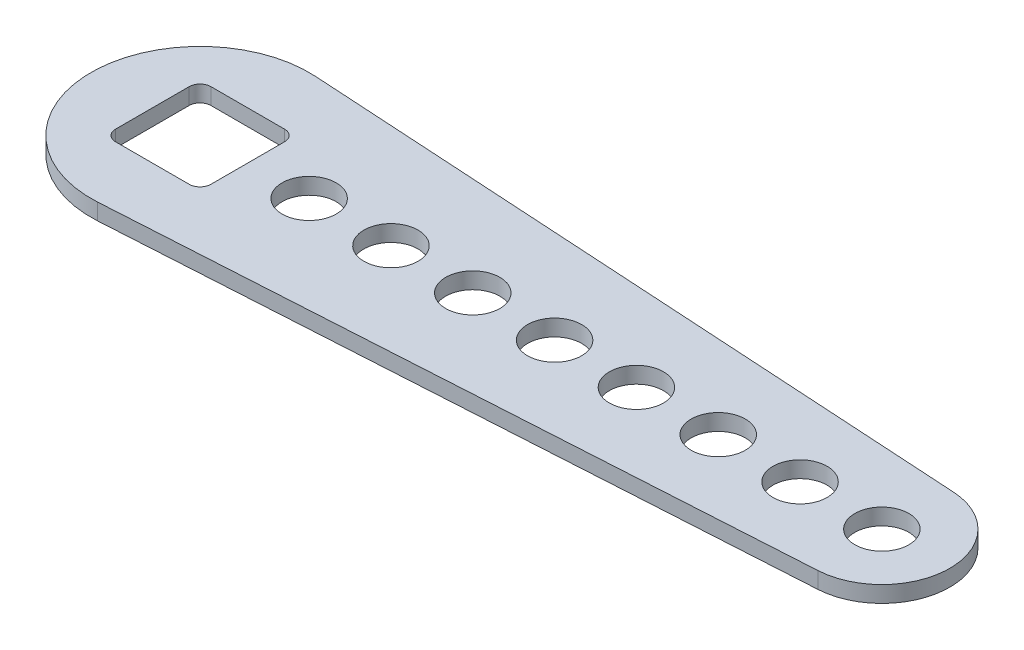
ISO-10303-21;
HEADER;
FILE_DESCRIPTION(('STEP AP214'),'2;1');
FILE_NAME('part.step','',(''),(''),'','','');
FILE_SCHEMA(('AUTOMOTIVE_DESIGN { 1 0 10303 214 1 1 1 1 }'));
ENDSEC;
DATA;
#1=APPLICATION_CONTEXT('core data for automotive mechanical design processes');
#2=APPLICATION_PROTOCOL_DEFINITION('international standard','automotive_design',2000,#1);
#3=PRODUCT_CONTEXT('',#1,'mechanical');
#4=PRODUCT('Part','Part','',(#3));
#5=PRODUCT_RELATED_PRODUCT_CATEGORY('part','',(#4));
#6=PRODUCT_DEFINITION_FORMATION('','',#4);
#7=PRODUCT_DEFINITION_CONTEXT('part definition',#1,'design');
#8=PRODUCT_DEFINITION('design','',#6,#7);
#9=PRODUCT_DEFINITION_SHAPE('','',#8);
#10=(LENGTH_UNIT() NAMED_UNIT(*) SI_UNIT(.MILLI.,.METRE.));
#11=(NAMED_UNIT(*) PLANE_ANGLE_UNIT() SI_UNIT($,.RADIAN.));
#12=(NAMED_UNIT(*) SI_UNIT($,.STERADIAN.) SOLID_ANGLE_UNIT());
#13=UNCERTAINTY_MEASURE_WITH_UNIT(LENGTH_MEASURE(1.E-05),#10,'distance_accuracy_value','');
#14=(GEOMETRIC_REPRESENTATION_CONTEXT(3) GLOBAL_UNCERTAINTY_ASSIGNED_CONTEXT((#13)) GLOBAL_UNIT_ASSIGNED_CONTEXT((#10,
#11,#12)) REPRESENTATION_CONTEXT('',''));
#15=CARTESIAN_POINT('',(0.,0.,0.));
#16=DIRECTION('',(0.,0.,1.));
#17=DIRECTION('',(1.,0.,0.));
#18=AXIS2_PLACEMENT_3D('',#15,#16,#17);
#19=CARTESIAN_POINT('',(0.,2.4,0.));
#20=DIRECTION('',(0.,1.,0.));
#21=DIRECTION('',(0.,0.,1.));
#22=AXIS2_PLACEMENT_3D('',#19,#20,#21);
#23=PLANE('',#22);
#24=CARTESIAN_POINT('',(88.,2.4,0.));
#25=DIRECTION('',(0.,1.,0.));
#26=DIRECTION('',(0.,0.,1.));
#27=AXIS2_PLACEMENT_3D('',#24,#25,#26);
#28=CIRCLE('',#27,3.96875);
#29=CARTESIAN_POINT('',(88.,2.4,3.96875));
#30=VERTEX_POINT('',#29);
#31=EDGE_CURVE('E159',#30,#30,#28,.T.);
#32=ORIENTED_EDGE('',*,*,#31,.F.);
#33=EDGE_LOOP('',(#32));
#34=FACE_BOUND('',#33,.T.);
#35=CARTESIAN_POINT('',(76.,2.4,0.));
#36=DIRECTION('',(0.,1.,0.));
#37=DIRECTION('',(0.,0.,1.));
#38=AXIS2_PLACEMENT_3D('',#35,#36,#37);
#39=CIRCLE('',#38,3.96875);
#40=CARTESIAN_POINT('',(76.,2.4,3.96875));
#41=VERTEX_POINT('',#40);
#42=EDGE_CURVE('E189',#41,#41,#39,.T.);
#43=ORIENTED_EDGE('',*,*,#42,.F.);
#44=EDGE_LOOP('',(#43));
#45=FACE_BOUND('',#44,.T.);
#46=CARTESIAN_POINT('',(52.,2.4,0.));
#47=DIRECTION('',(0.,1.,0.));
#48=DIRECTION('',(0.,0.,1.));
#49=AXIS2_PLACEMENT_3D('',#46,#47,#48);
#50=CIRCLE('',#49,3.96875);
#51=CARTESIAN_POINT('',(52.,2.4,3.96875));
#52=VERTEX_POINT('',#51);
#53=EDGE_CURVE('E201',#52,#52,#50,.T.);
#54=ORIENTED_EDGE('',*,*,#53,.F.);
#55=EDGE_LOOP('',(#54));
#56=FACE_BOUND('',#55,.T.);
#57=CARTESIAN_POINT('',(28.,2.4,0.));
#58=DIRECTION('',(0.,1.,0.));
#59=DIRECTION('',(0.,0.,1.));
#60=AXIS2_PLACEMENT_3D('',#57,#58,#59);
#61=CIRCLE('',#60,3.96875);
#62=CARTESIAN_POINT('',(28.,2.4,3.96875));
#63=VERTEX_POINT('',#62);
#64=EDGE_CURVE('E213',#63,#63,#61,.T.);
#65=ORIENTED_EDGE('',*,*,#64,.F.);
#66=EDGE_LOOP('',(#65));
#67=FACE_BOUND('',#66,.T.);
#68=CARTESIAN_POINT('',(0.,2.4,0.));
#69=DIRECTION('',(0.,1.,0.));
#70=DIRECTION('',(0.,0.,1.));
#71=AXIS2_PLACEMENT_3D('',#68,#69,#70);
#72=CIRCLE('',#71,16.);
#73=CARTESIAN_POINT('',(0.964999999999989,2.4,-15.9708727062737));
#74=VERTEX_POINT('',#73);
#75=CARTESIAN_POINT('',(0.964999999999989,2.4,15.9708727062737));
#76=VERTEX_POINT('',#75);
#77=EDGE_CURVE('E225',#74,#76,#72,.T.);
#78=ORIENTED_EDGE('',*,*,#77,.T.);
#79=DIRECTION('',(0.99817954414211,0.,-0.0603125));
#80=VECTOR('',#79,1.);
#81=CARTESIAN_POINT('',(0.964999999999989,2.4,15.9708727062737));
#82=LINE('',#81,#80);
#83=CARTESIAN_POINT('',(100.601240234375,2.4,9.95060233066665));
#84=VERTEX_POINT('',#83);
#85=EDGE_CURVE('E228',#76,#84,#82,.T.);
#86=ORIENTED_EDGE('',*,*,#85,.T.);
#87=CARTESIAN_POINT('',(100.,2.4,0.));
#88=DIRECTION('',(0.,1.,0.));
#89=DIRECTION('',(0.,0.,-1.));
#90=AXIS2_PLACEMENT_3D('',#87,#88,#89);
#91=CIRCLE('',#90,9.96874999999999);
#92=CARTESIAN_POINT('',(100.601240234375,2.4,-9.95060233066665));
#93=VERTEX_POINT('',#92);
#94=EDGE_CURVE('E231',#84,#93,#91,.T.);
#95=ORIENTED_EDGE('',*,*,#94,.T.);
#96=DIRECTION('',(-0.99817954414211,0.,-0.0603125));
#97=VECTOR('',#96,1.);
#98=CARTESIAN_POINT('',(0.964999999999989,2.4,-15.9708727062737));
#99=LINE('',#98,#97);
#100=EDGE_CURVE('E233',#93,#74,#99,.T.);
#101=ORIENTED_EDGE('',*,*,#100,.T.);
#102=EDGE_LOOP('',(#78,#86,#95,#101));
#103=FACE_BOUND('',#102,.T.);
#104=CARTESIAN_POINT('',(16.,2.4,0.));
#105=DIRECTION('',(0.,1.,0.));
#106=DIRECTION('',(0.,0.,1.));
#107=AXIS2_PLACEMENT_3D('',#104,#105,#106);
#108=CIRCLE('',#107,3.96875);
#109=CARTESIAN_POINT('',(16.,2.4,3.96875));
#110=VERTEX_POINT('',#109);
#111=EDGE_CURVE('E219',#110,#110,#108,.T.);
#112=ORIENTED_EDGE('',*,*,#111,.F.);
#113=EDGE_LOOP('',(#112));
#114=FACE_BOUND('',#113,.T.);
#115=CARTESIAN_POINT('',(40.,2.4,0.));
#116=DIRECTION('',(0.,1.,0.));
#117=DIRECTION('',(0.,0.,1.));
#118=AXIS2_PLACEMENT_3D('',#115,#116,#117);
#119=CIRCLE('',#118,3.96875);
#120=CARTESIAN_POINT('',(40.,2.4,3.96875));
#121=VERTEX_POINT('',#120);
#122=EDGE_CURVE('E207',#121,#121,#119,.T.);
#123=ORIENTED_EDGE('',*,*,#122,.F.);
#124=EDGE_LOOP('',(#123));
#125=FACE_BOUND('',#124,.T.);
#126=CARTESIAN_POINT('',(64.,2.4,0.));
#127=DIRECTION('',(0.,1.,0.));
#128=DIRECTION('',(0.,0.,1.));
#129=AXIS2_PLACEMENT_3D('',#126,#127,#128);
#130=CIRCLE('',#129,3.96875);
#131=CARTESIAN_POINT('',(64.,2.4,3.96875));
#132=VERTEX_POINT('',#131);
#133=EDGE_CURVE('E195',#132,#132,#130,.T.);
#134=ORIENTED_EDGE('',*,*,#133,.F.);
#135=EDGE_LOOP('',(#134));
#136=FACE_BOUND('',#135,.T.);
#137=DIRECTION('',(1.,0.,0.));
#138=VECTOR('',#137,1.);
#139=CARTESIAN_POINT('',(-5.4,2.4,7.));
#140=LINE('',#139,#138);
#141=CARTESIAN_POINT('',(-5.4,2.4,7.));
#142=VERTEX_POINT('',#141);
#143=CARTESIAN_POINT('',(5.39999999999998,2.4,7.));
#144=VERTEX_POINT('',#143);
#145=EDGE_CURVE('E129',#142,#144,#140,.T.);
#146=ORIENTED_EDGE('',*,*,#145,.F.);
#147=CARTESIAN_POINT('',(-5.40000000000001,2.4,5.4));
#148=DIRECTION('',(0.,1.,0.));
#149=DIRECTION('',(0.,0.,1.));
#150=AXIS2_PLACEMENT_3D('',#147,#148,#149);
#151=CIRCLE('',#150,1.6);
#152=CARTESIAN_POINT('',(-7.00000000000001,2.4,5.39999999999999));
#153=VERTEX_POINT('',#152);
#154=EDGE_CURVE('E121',#153,#142,#151,.T.);
#155=ORIENTED_EDGE('',*,*,#154,.F.);
#156=DIRECTION('',(0.,0.,1.));
#157=VECTOR('',#156,1.);
#158=CARTESIAN_POINT('',(-7.00000000000001,2.4,-5.39999999999999));
#159=LINE('',#158,#157);
#160=CARTESIAN_POINT('',(-7.00000000000001,2.4,-5.39999999999999));
#161=VERTEX_POINT('',#160);
#162=EDGE_CURVE('E156',#161,#153,#159,.T.);
#163=ORIENTED_EDGE('',*,*,#162,.F.);
#164=CARTESIAN_POINT('',(-5.40000000000001,2.4,-5.4));
#165=DIRECTION('',(0.,1.,0.));
#166=DIRECTION('',(0.,0.,1.));
#167=AXIS2_PLACEMENT_3D('',#164,#165,#166);
#168=CIRCLE('',#167,1.6);
#169=CARTESIAN_POINT('',(-5.4,2.4,-7.));
#170=VERTEX_POINT('',#169);
#171=EDGE_CURVE('E154',#170,#161,#168,.T.);
#172=ORIENTED_EDGE('',*,*,#171,.F.);
#173=DIRECTION('',(-1.,0.,0.));
#174=VECTOR('',#173,1.);
#175=CARTESIAN_POINT('',(-5.4,2.4,-7.));
#176=LINE('',#175,#174);
#177=CARTESIAN_POINT('',(5.39999999999998,2.4,-7.));
#178=VERTEX_POINT('',#177);
#179=EDGE_CURVE('E152',#178,#170,#176,.T.);
#180=ORIENTED_EDGE('',*,*,#179,.F.);
#181=CARTESIAN_POINT('',(5.39999999999999,2.4,-5.4));
#182=DIRECTION('',(0.,1.,0.));
#183=DIRECTION('',(0.,0.,-1.));
#184=AXIS2_PLACEMENT_3D('',#181,#182,#183);
#185=CIRCLE('',#184,1.6);
#186=CARTESIAN_POINT('',(6.99999999999999,2.4,-5.39999999999999));
#187=VERTEX_POINT('',#186);
#188=EDGE_CURVE('E150',#187,#178,#185,.T.);
#189=ORIENTED_EDGE('',*,*,#188,.F.);
#190=DIRECTION('',(0.,0.,-1.));
#191=VECTOR('',#190,1.);
#192=CARTESIAN_POINT('',(6.99999999999999,2.4,-5.39999999999999));
#193=LINE('',#192,#191);
#194=CARTESIAN_POINT('',(6.99999999999999,2.4,5.39999999999998));
#195=VERTEX_POINT('',#194);
#196=EDGE_CURVE('E145',#195,#187,#193,.T.);
#197=ORIENTED_EDGE('',*,*,#196,.F.);
#198=CARTESIAN_POINT('',(5.39999999999999,2.4,5.4));
#199=DIRECTION('',(0.,1.,0.));
#200=DIRECTION('',(0.,0.,1.));
#201=AXIS2_PLACEMENT_3D('',#198,#199,#200);
#202=CIRCLE('',#201,1.6);
#203=EDGE_CURVE('E143',#144,#195,#202,.T.);
#204=ORIENTED_EDGE('',*,*,#203,.F.);
#205=EDGE_LOOP('',(#146,#155,#163,#172,#180,#189,#197,#204));
#206=FACE_BOUND('',#205,.T.);
#207=CARTESIAN_POINT('',(100.,2.4,0.));
#208=DIRECTION('',(0.,1.,0.));
#209=DIRECTION('',(0.,0.,1.));
#210=AXIS2_PLACEMENT_3D('',#207,#208,#209);
#211=CIRCLE('',#210,3.96875);
#212=CARTESIAN_POINT('',(100.,2.4,3.96875));
#213=VERTEX_POINT('',#212);
#214=EDGE_CURVE('E314',#213,#213,#211,.T.);
#215=ORIENTED_EDGE('',*,*,#214,.F.);
#216=EDGE_LOOP('',(#215));
#217=FACE_BOUND('',#216,.T.);
#218=ADVANCED_FACE('F32',(#34,#45,#56,#67,#103,#114,#125,#136,#206,#217),#23,.T.);
#219=CARTESIAN_POINT('',(0.,0.,0.));
#220=DIRECTION('',(0.,1.,0.));
#221=DIRECTION('',(0.,0.,1.));
#222=AXIS2_PLACEMENT_3D('',#219,#220,#221);
#223=PLANE('',#222);
#224=CARTESIAN_POINT('',(88.,0.,0.));
#225=DIRECTION('',(0.,1.,0.));
#226=DIRECTION('',(0.,0.,1.));
#227=AXIS2_PLACEMENT_3D('',#224,#225,#226);
#228=CIRCLE('',#227,3.96875);
#229=CARTESIAN_POINT('',(88.,0.,3.96875));
#230=VERTEX_POINT('',#229);
#231=EDGE_CURVE('E317',#230,#230,#228,.T.);
#232=ORIENTED_EDGE('',*,*,#231,.T.);
#233=EDGE_LOOP('',(#232));
#234=FACE_BOUND('',#233,.T.);
#235=CARTESIAN_POINT('',(76.,0.,0.));
#236=DIRECTION('',(0.,1.,0.));
#237=DIRECTION('',(0.,0.,1.));
#238=AXIS2_PLACEMENT_3D('',#235,#236,#237);
#239=CIRCLE('',#238,3.96875);
#240=CARTESIAN_POINT('',(76.,0.,3.96875));
#241=VERTEX_POINT('',#240);
#242=EDGE_CURVE('E137',#241,#241,#239,.T.);
#243=ORIENTED_EDGE('',*,*,#242,.T.);
#244=EDGE_LOOP('',(#243));
#245=FACE_BOUND('',#244,.T.);
#246=CARTESIAN_POINT('',(52.,0.,0.));
#247=DIRECTION('',(0.,1.,0.));
#248=DIRECTION('',(0.,0.,1.));
#249=AXIS2_PLACEMENT_3D('',#246,#247,#248);
#250=CIRCLE('',#249,3.96875);
#251=CARTESIAN_POINT('',(52.,0.,3.96875));
#252=VERTEX_POINT('',#251);
#253=EDGE_CURVE('E198',#252,#252,#250,.T.);
#254=ORIENTED_EDGE('',*,*,#253,.T.);
#255=EDGE_LOOP('',(#254));
#256=FACE_BOUND('',#255,.T.);
#257=CARTESIAN_POINT('',(28.,0.,0.));
#258=DIRECTION('',(0.,1.,0.));
#259=DIRECTION('',(0.,0.,1.));
#260=AXIS2_PLACEMENT_3D('',#257,#258,#259);
#261=CIRCLE('',#260,3.96875);
#262=CARTESIAN_POINT('',(28.,0.,3.96875));
#263=VERTEX_POINT('',#262);
#264=EDGE_CURVE('E210',#263,#263,#261,.T.);
#265=ORIENTED_EDGE('',*,*,#264,.T.);
#266=EDGE_LOOP('',(#265));
#267=FACE_BOUND('',#266,.T.);
#268=CARTESIAN_POINT('',(0.,0.,0.));
#269=DIRECTION('',(0.,1.,0.));
#270=DIRECTION('',(0.,0.,1.));
#271=AXIS2_PLACEMENT_3D('',#268,#269,#270);
#272=CIRCLE('',#271,16.);
#273=CARTESIAN_POINT('',(0.964999999999989,0.,-15.9708727062737));
#274=VERTEX_POINT('',#273);
#275=CARTESIAN_POINT('',(0.964999999999989,0.,15.9708727062737));
#276=VERTEX_POINT('',#275);
#277=EDGE_CURVE('E222',#274,#276,#272,.T.);
#278=ORIENTED_EDGE('',*,*,#277,.F.);
#279=DIRECTION('',(-0.99817954414211,0.,-0.0603125));
#280=VECTOR('',#279,1.);
#281=CARTESIAN_POINT('',(0.964999999999989,0.,-15.9708727062737));
#282=LINE('',#281,#280);
#283=CARTESIAN_POINT('',(100.601240234375,0.,-9.95060233066665));
#284=VERTEX_POINT('',#283);
#285=EDGE_CURVE('E229',#284,#274,#282,.T.);
#286=ORIENTED_EDGE('',*,*,#285,.F.);
#287=CARTESIAN_POINT('',(100.,0.,0.));
#288=DIRECTION('',(0.,1.,0.));
#289=DIRECTION('',(0.,0.,-1.));
#290=AXIS2_PLACEMENT_3D('',#287,#288,#289);
#291=CIRCLE('',#290,9.96874999999999);
#292=CARTESIAN_POINT('',(100.601240234375,0.,9.95060233066665));
#293=VERTEX_POINT('',#292);
#294=EDGE_CURVE('E240',#293,#284,#291,.T.);
#295=ORIENTED_EDGE('',*,*,#294,.F.);
#296=DIRECTION('',(0.99817954414211,0.,-0.0603125));
#297=VECTOR('',#296,1.);
#298=CARTESIAN_POINT('',(0.964999999999989,0.,15.9708727062737));
#299=LINE('',#298,#297);
#300=EDGE_CURVE('E238',#276,#293,#299,.T.);
#301=ORIENTED_EDGE('',*,*,#300,.F.);
#302=EDGE_LOOP('',(#278,#286,#295,#301));
#303=FACE_BOUND('',#302,.T.);
#304=CARTESIAN_POINT('',(16.,0.,0.));
#305=DIRECTION('',(0.,1.,0.));
#306=DIRECTION('',(0.,0.,1.));
#307=AXIS2_PLACEMENT_3D('',#304,#305,#306);
#308=CIRCLE('',#307,3.96875);
#309=CARTESIAN_POINT('',(16.,0.,3.96875));
#310=VERTEX_POINT('',#309);
#311=EDGE_CURVE('E216',#310,#310,#308,.T.);
#312=ORIENTED_EDGE('',*,*,#311,.T.);
#313=EDGE_LOOP('',(#312));
#314=FACE_BOUND('',#313,.T.);
#315=CARTESIAN_POINT('',(40.,0.,0.));
#316=DIRECTION('',(0.,1.,0.));
#317=DIRECTION('',(0.,0.,1.));
#318=AXIS2_PLACEMENT_3D('',#315,#316,#317);
#319=CIRCLE('',#318,3.96875);
#320=CARTESIAN_POINT('',(40.,0.,3.96875));
#321=VERTEX_POINT('',#320);
#322=EDGE_CURVE('E204',#321,#321,#319,.T.);
#323=ORIENTED_EDGE('',*,*,#322,.T.);
#324=EDGE_LOOP('',(#323));
#325=FACE_BOUND('',#324,.T.);
#326=CARTESIAN_POINT('',(64.,0.,0.));
#327=DIRECTION('',(0.,1.,0.));
#328=DIRECTION('',(0.,0.,1.));
#329=AXIS2_PLACEMENT_3D('',#326,#327,#328);
#330=CIRCLE('',#329,3.96875);
#331=CARTESIAN_POINT('',(64.,0.,3.96875));
#332=VERTEX_POINT('',#331);
#333=EDGE_CURVE('E192',#332,#332,#330,.T.);
#334=ORIENTED_EDGE('',*,*,#333,.T.);
#335=EDGE_LOOP('',(#334));
#336=FACE_BOUND('',#335,.T.);
#337=CARTESIAN_POINT('',(-5.40000000000001,0.,5.4));
#338=DIRECTION('',(0.,1.,0.));
#339=DIRECTION('',(0.,0.,1.));
#340=AXIS2_PLACEMENT_3D('',#337,#338,#339);
#341=CIRCLE('',#340,1.6);
#342=CARTESIAN_POINT('',(-7.00000000000001,0.,5.39999999999999));
#343=VERTEX_POINT('',#342);
#344=CARTESIAN_POINT('',(-5.4,0.,7.));
#345=VERTEX_POINT('',#344);
#346=EDGE_CURVE('E55',#343,#345,#341,.T.);
#347=ORIENTED_EDGE('',*,*,#346,.T.);
#348=DIRECTION('',(1.,0.,0.));
#349=VECTOR('',#348,1.);
#350=CARTESIAN_POINT('',(-5.4,0.,7.));
#351=LINE('',#350,#349);
#352=CARTESIAN_POINT('',(5.39999999999998,0.,7.));
#353=VERTEX_POINT('',#352);
#354=EDGE_CURVE('E136',#345,#353,#351,.T.);
#355=ORIENTED_EDGE('',*,*,#354,.T.);
#356=CARTESIAN_POINT('',(5.39999999999999,0.,5.4));
#357=DIRECTION('',(0.,1.,0.));
#358=DIRECTION('',(0.,0.,1.));
#359=AXIS2_PLACEMENT_3D('',#356,#357,#358);
#360=CIRCLE('',#359,1.6);
#361=CARTESIAN_POINT('',(6.99999999999999,0.,5.39999999999998));
#362=VERTEX_POINT('',#361);
#363=EDGE_CURVE('E161',#353,#362,#360,.T.);
#364=ORIENTED_EDGE('',*,*,#363,.T.);
#365=DIRECTION('',(0.,0.,-1.));
#366=VECTOR('',#365,1.);
#367=CARTESIAN_POINT('',(6.99999999999999,0.,-5.39999999999999));
#368=LINE('',#367,#366);
#369=CARTESIAN_POINT('',(6.99999999999999,0.,-5.39999999999999));
#370=VERTEX_POINT('',#369);
#371=EDGE_CURVE('E164',#362,#370,#368,.T.);
#372=ORIENTED_EDGE('',*,*,#371,.T.);
#373=CARTESIAN_POINT('',(5.39999999999999,0.,-5.4));
#374=DIRECTION('',(0.,1.,0.));
#375=DIRECTION('',(0.,0.,-1.));
#376=AXIS2_PLACEMENT_3D('',#373,#374,#375);
#377=CIRCLE('',#376,1.6);
#378=CARTESIAN_POINT('',(5.39999999999998,0.,-7.));
#379=VERTEX_POINT('',#378);
#380=EDGE_CURVE('E167',#370,#379,#377,.T.);
#381=ORIENTED_EDGE('',*,*,#380,.T.);
#382=DIRECTION('',(-1.,0.,0.));
#383=VECTOR('',#382,1.);
#384=CARTESIAN_POINT('',(-5.4,0.,-7.));
#385=LINE('',#384,#383);
#386=CARTESIAN_POINT('',(-5.4,0.,-7.));
#387=VERTEX_POINT('',#386);
#388=EDGE_CURVE('E170',#379,#387,#385,.T.);
#389=ORIENTED_EDGE('',*,*,#388,.T.);
#390=CARTESIAN_POINT('',(-5.40000000000001,0.,-5.4));
#391=DIRECTION('',(0.,1.,0.));
#392=DIRECTION('',(0.,0.,1.));
#393=AXIS2_PLACEMENT_3D('',#390,#391,#392);
#394=CIRCLE('',#393,1.6);
#395=CARTESIAN_POINT('',(-7.00000000000001,0.,-5.39999999999999));
#396=VERTEX_POINT('',#395);
#397=EDGE_CURVE('E173',#387,#396,#394,.T.);
#398=ORIENTED_EDGE('',*,*,#397,.T.);
#399=DIRECTION('',(0.,0.,1.));
#400=VECTOR('',#399,1.);
#401=CARTESIAN_POINT('',(-7.00000000000001,0.,-5.39999999999999));
#402=LINE('',#401,#400);
#403=EDGE_CURVE('E130',#396,#343,#402,.T.);
#404=ORIENTED_EDGE('',*,*,#403,.T.);
#405=EDGE_LOOP('',(#347,#355,#364,#372,#381,#389,#398,#404));
#406=FACE_BOUND('',#405,.T.);
#407=CARTESIAN_POINT('',(100.,0.,0.));
#408=DIRECTION('',(0.,1.,0.));
#409=DIRECTION('',(0.,0.,1.));
#410=AXIS2_PLACEMENT_3D('',#407,#408,#409);
#411=CIRCLE('',#410,3.96875);
#412=CARTESIAN_POINT('',(100.,0.,3.96875));
#413=VERTEX_POINT('',#412);
#414=EDGE_CURVE('E312',#413,#413,#411,.T.);
#415=ORIENTED_EDGE('',*,*,#414,.T.);
#416=EDGE_LOOP('',(#415));
#417=FACE_BOUND('',#416,.T.);
#418=ADVANCED_FACE('F258',(#234,#245,#256,#267,#303,#314,#325,#336,#406,#417),#223,.F.);
#419=CARTESIAN_POINT('',(0.,2.4,0.));
#420=DIRECTION('',(0.,-1.,0.));
#421=DIRECTION('',(0.,0.,-1.));
#422=AXIS2_PLACEMENT_3D('',#419,#420,#421);
#423=CYLINDRICAL_SURFACE('',#422,16.);
#424=ORIENTED_EDGE('',*,*,#277,.T.);
#425=DIRECTION('',(0.,-1.,0.));
#426=VECTOR('',#425,1.);
#427=CARTESIAN_POINT('',(0.964999999999989,2.4,15.9708727062737));
#428=LINE('',#427,#426);
#429=EDGE_CURVE('E11',#76,#276,#428,.T.);
#430=ORIENTED_EDGE('',*,*,#429,.F.);
#431=ORIENTED_EDGE('',*,*,#77,.F.);
#432=DIRECTION('',(0.,-1.,0.));
#433=VECTOR('',#432,1.);
#434=CARTESIAN_POINT('',(0.964999999999989,2.4,-15.9708727062737));
#435=LINE('',#434,#433);
#436=EDGE_CURVE('E235',#74,#274,#435,.T.);
#437=ORIENTED_EDGE('',*,*,#436,.T.);
#438=EDGE_LOOP('',(#424,#430,#431,#437));
#439=FACE_BOUND('',#438,.T.);
#440=ADVANCED_FACE('F34',(#439),#423,.T.);
#441=CARTESIAN_POINT('',(0.964999999999989,2.4,15.9708727062737));
#442=DIRECTION('',(-0.0603125,0.,-0.99817954414211));
#443=DIRECTION('',(-0.99817954414211,0.,0.0603125));
#444=AXIS2_PLACEMENT_3D('',#441,#442,#443);
#445=PLANE('',#444);
#446=ORIENTED_EDGE('',*,*,#300,.T.);
#447=DIRECTION('',(0.,-1.,0.));
#448=VECTOR('',#447,1.);
#449=CARTESIAN_POINT('',(100.601240234375,2.4,9.95060233066665));
#450=LINE('',#449,#448);
#451=EDGE_CURVE('E40',#84,#293,#450,.T.);
#452=ORIENTED_EDGE('',*,*,#451,.F.);
#453=ORIENTED_EDGE('',*,*,#85,.F.);
#454=ORIENTED_EDGE('',*,*,#429,.T.);
#455=EDGE_LOOP('',(#446,#452,#453,#454));
#456=FACE_BOUND('',#455,.T.);
#457=ADVANCED_FACE('F269',(#456),#445,.F.);
#458=CARTESIAN_POINT('',(100.,2.4,0.));
#459=DIRECTION('',(0.,-1.,0.));
#460=DIRECTION('',(0.,0.,-1.));
#461=AXIS2_PLACEMENT_3D('',#458,#459,#460);
#462=CYLINDRICAL_SURFACE('',#461,9.96874999999999);
#463=ORIENTED_EDGE('',*,*,#294,.T.);
#464=DIRECTION('',(0.,-1.,0.));
#465=VECTOR('',#464,1.);
#466=CARTESIAN_POINT('',(100.601240234375,2.4,-9.95060233066665));
#467=LINE('',#466,#465);
#468=EDGE_CURVE('E245',#93,#284,#467,.T.);
#469=ORIENTED_EDGE('',*,*,#468,.F.);
#470=ORIENTED_EDGE('',*,*,#94,.F.);
#471=ORIENTED_EDGE('',*,*,#451,.T.);
#472=EDGE_LOOP('',(#463,#469,#470,#471));
#473=FACE_BOUND('',#472,.T.);
#474=ADVANCED_FACE('F252',(#473),#462,.T.);
#475=CARTESIAN_POINT('',(0.964999999999989,2.4,-15.9708727062737));
#476=DIRECTION('',(-0.0603125,0.,0.99817954414211));
#477=DIRECTION('',(0.99817954414211,0.,0.0603125));
#478=AXIS2_PLACEMENT_3D('',#475,#476,#477);
#479=PLANE('',#478);
#480=ORIENTED_EDGE('',*,*,#285,.T.);
#481=ORIENTED_EDGE('',*,*,#436,.F.);
#482=ORIENTED_EDGE('',*,*,#100,.F.);
#483=ORIENTED_EDGE('',*,*,#468,.T.);
#484=EDGE_LOOP('',(#480,#481,#482,#483));
#485=FACE_BOUND('',#484,.T.);
#486=ADVANCED_FACE('F262',(#485),#479,.F.);
#487=CARTESIAN_POINT('',(16.,2.4,0.));
#488=DIRECTION('',(0.,-1.,0.));
#489=DIRECTION('',(0.,0.,-1.));
#490=AXIS2_PLACEMENT_3D('',#487,#488,#489);
#491=CYLINDRICAL_SURFACE('',#490,3.96875);
#492=ORIENTED_EDGE('',*,*,#111,.T.);
#493=EDGE_LOOP('',(#492));
#494=FACE_BOUND('',#493,.T.);
#495=ORIENTED_EDGE('',*,*,#311,.F.);
#496=EDGE_LOOP('',(#495));
#497=FACE_BOUND('',#496,.T.);
#498=ADVANCED_FACE('F287',(#494,#497),#491,.F.);
#499=CARTESIAN_POINT('',(28.,2.4,0.));
#500=DIRECTION('',(0.,-1.,0.));
#501=DIRECTION('',(0.,0.,-1.));
#502=AXIS2_PLACEMENT_3D('',#499,#500,#501);
#503=CYLINDRICAL_SURFACE('',#502,3.96875);
#504=ORIENTED_EDGE('',*,*,#64,.T.);
#505=EDGE_LOOP('',(#504));
#506=FACE_BOUND('',#505,.T.);
#507=ORIENTED_EDGE('',*,*,#264,.F.);
#508=EDGE_LOOP('',(#507));
#509=FACE_BOUND('',#508,.T.);
#510=ADVANCED_FACE('F294',(#506,#509),#503,.F.);
#511=CARTESIAN_POINT('',(40.,2.4,0.));
#512=DIRECTION('',(0.,-1.,0.));
#513=DIRECTION('',(0.,0.,-1.));
#514=AXIS2_PLACEMENT_3D('',#511,#512,#513);
#515=CYLINDRICAL_SURFACE('',#514,3.96875);
#516=ORIENTED_EDGE('',*,*,#122,.T.);
#517=EDGE_LOOP('',(#516));
#518=FACE_BOUND('',#517,.T.);
#519=ORIENTED_EDGE('',*,*,#322,.F.);
#520=EDGE_LOOP('',(#519));
#521=FACE_BOUND('',#520,.T.);
#522=ADVANCED_FACE('F299',(#518,#521),#515,.F.);
#523=CARTESIAN_POINT('',(52.,2.4,0.));
#524=DIRECTION('',(0.,-1.,0.));
#525=DIRECTION('',(0.,0.,-1.));
#526=AXIS2_PLACEMENT_3D('',#523,#524,#525);
#527=CYLINDRICAL_SURFACE('',#526,3.96875);
#528=ORIENTED_EDGE('',*,*,#53,.T.);
#529=EDGE_LOOP('',(#528));
#530=FACE_BOUND('',#529,.T.);
#531=ORIENTED_EDGE('',*,*,#253,.F.);
#532=EDGE_LOOP('',(#531));
#533=FACE_BOUND('',#532,.T.);
#534=ADVANCED_FACE('F370',(#530,#533),#527,.F.);
#535=CARTESIAN_POINT('',(64.,2.4,0.));
#536=DIRECTION('',(0.,-1.,0.));
#537=DIRECTION('',(0.,0.,-1.));
#538=AXIS2_PLACEMENT_3D('',#535,#536,#537);
#539=CYLINDRICAL_SURFACE('',#538,3.96875);
#540=ORIENTED_EDGE('',*,*,#133,.T.);
#541=EDGE_LOOP('',(#540));
#542=FACE_BOUND('',#541,.T.);
#543=ORIENTED_EDGE('',*,*,#333,.F.);
#544=EDGE_LOOP('',(#543));
#545=FACE_BOUND('',#544,.T.);
#546=ADVANCED_FACE('F366',(#542,#545),#539,.F.);
#547=CARTESIAN_POINT('',(76.,2.4,0.));
#548=DIRECTION('',(0.,-1.,0.));
#549=DIRECTION('',(0.,0.,-1.));
#550=AXIS2_PLACEMENT_3D('',#547,#548,#549);
#551=CYLINDRICAL_SURFACE('',#550,3.96875);
#552=ORIENTED_EDGE('',*,*,#42,.T.);
#553=EDGE_LOOP('',(#552));
#554=FACE_BOUND('',#553,.T.);
#555=ORIENTED_EDGE('',*,*,#242,.F.);
#556=EDGE_LOOP('',(#555));
#557=FACE_BOUND('',#556,.T.);
#558=ADVANCED_FACE('F363',(#554,#557),#551,.F.);
#559=CARTESIAN_POINT('',(-5.40000000000001,2.4,5.4));
#560=DIRECTION('',(0.,-1.,0.));
#561=DIRECTION('',(0.,0.,-1.));
#562=AXIS2_PLACEMENT_3D('',#559,#560,#561);
#563=CYLINDRICAL_SURFACE('',#562,1.6);
#564=ORIENTED_EDGE('',*,*,#346,.F.);
#565=DIRECTION('',(0.,-1.,0.));
#566=VECTOR('',#565,1.);
#567=CARTESIAN_POINT('',(-7.00000000000001,2.4,5.39999999999999));
#568=LINE('',#567,#566);
#569=EDGE_CURVE('E125',#153,#343,#568,.T.);
#570=ORIENTED_EDGE('',*,*,#569,.F.);
#571=ORIENTED_EDGE('',*,*,#154,.T.);
#572=DIRECTION('',(0.,-1.,0.));
#573=VECTOR('',#572,1.);
#574=CARTESIAN_POINT('',(-5.4,2.4,7.));
#575=LINE('',#574,#573);
#576=EDGE_CURVE('E124',#142,#345,#575,.T.);
#577=ORIENTED_EDGE('',*,*,#576,.T.);
#578=EDGE_LOOP('',(#564,#570,#571,#577));
#579=FACE_BOUND('',#578,.T.);
#580=ADVANCED_FACE('F123',(#579),#563,.F.);
#581=CARTESIAN_POINT('',(-5.4,2.4,7.));
#582=DIRECTION('',(0.,0.,-1.));
#583=DIRECTION('',(-1.,0.,0.));
#584=AXIS2_PLACEMENT_3D('',#581,#582,#583);
#585=PLANE('',#584);
#586=ORIENTED_EDGE('',*,*,#354,.F.);
#587=ORIENTED_EDGE('',*,*,#576,.F.);
#588=ORIENTED_EDGE('',*,*,#145,.T.);
#589=DIRECTION('',(0.,-1.,0.));
#590=VECTOR('',#589,1.);
#591=CARTESIAN_POINT('',(5.39999999999998,2.4,7.));
#592=LINE('',#591,#590);
#593=EDGE_CURVE('E138',#144,#353,#592,.T.);
#594=ORIENTED_EDGE('',*,*,#593,.T.);
#595=EDGE_LOOP('',(#586,#587,#588,#594));
#596=FACE_BOUND('',#595,.T.);
#597=ADVANCED_FACE('F133',(#596),#585,.T.);
#598=CARTESIAN_POINT('',(5.39999999999999,2.4,5.4));
#599=DIRECTION('',(0.,-1.,0.));
#600=DIRECTION('',(0.,0.,-1.));
#601=AXIS2_PLACEMENT_3D('',#598,#599,#600);
#602=CYLINDRICAL_SURFACE('',#601,1.6);
#603=ORIENTED_EDGE('',*,*,#363,.F.);
#604=ORIENTED_EDGE('',*,*,#593,.F.);
#605=ORIENTED_EDGE('',*,*,#203,.T.);
#606=DIRECTION('',(0.,-1.,0.));
#607=VECTOR('',#606,1.);
#608=CARTESIAN_POINT('',(6.99999999999999,2.4,5.39999999999998));
#609=LINE('',#608,#607);
#610=EDGE_CURVE('E186',#195,#362,#609,.T.);
#611=ORIENTED_EDGE('',*,*,#610,.T.);
#612=EDGE_LOOP('',(#603,#604,#605,#611));
#613=FACE_BOUND('',#612,.T.);
#614=ADVANCED_FACE('F354',(#613),#602,.F.);
#615=CARTESIAN_POINT('',(6.99999999999999,2.4,-5.39999999999999));
#616=DIRECTION('',(-1.,0.,0.));
#617=DIRECTION('',(0.,0.,1.));
#618=AXIS2_PLACEMENT_3D('',#615,#616,#617);
#619=PLANE('',#618);
#620=ORIENTED_EDGE('',*,*,#371,.F.);
#621=ORIENTED_EDGE('',*,*,#610,.F.);
#622=ORIENTED_EDGE('',*,*,#196,.T.);
#623=DIRECTION('',(0.,-1.,0.));
#624=VECTOR('',#623,1.);
#625=CARTESIAN_POINT('',(6.99999999999999,2.4,-5.39999999999999));
#626=LINE('',#625,#624);
#627=EDGE_CURVE('E184',#187,#370,#626,.T.);
#628=ORIENTED_EDGE('',*,*,#627,.T.);
#629=EDGE_LOOP('',(#620,#621,#622,#628));
#630=FACE_BOUND('',#629,.T.);
#631=ADVANCED_FACE('F350',(#630),#619,.T.);
#632=CARTESIAN_POINT('',(5.39999999999999,2.4,-5.4));
#633=DIRECTION('',(0.,-1.,0.));
#634=DIRECTION('',(0.,0.,-1.));
#635=AXIS2_PLACEMENT_3D('',#632,#633,#634);
#636=CYLINDRICAL_SURFACE('',#635,1.6);
#637=ORIENTED_EDGE('',*,*,#380,.F.);
#638=ORIENTED_EDGE('',*,*,#627,.F.);
#639=ORIENTED_EDGE('',*,*,#188,.T.);
#640=DIRECTION('',(0.,-1.,0.));
#641=VECTOR('',#640,1.);
#642=CARTESIAN_POINT('',(5.39999999999998,2.4,-7.));
#643=LINE('',#642,#641);
#644=EDGE_CURVE('E182',#178,#379,#643,.T.);
#645=ORIENTED_EDGE('',*,*,#644,.T.);
#646=EDGE_LOOP('',(#637,#638,#639,#645));
#647=FACE_BOUND('',#646,.T.);
#648=ADVANCED_FACE('F346',(#647),#636,.F.);
#649=CARTESIAN_POINT('',(-5.4,2.4,-7.));
#650=DIRECTION('',(0.,0.,1.));
#651=DIRECTION('',(1.,0.,0.));
#652=AXIS2_PLACEMENT_3D('',#649,#650,#651);
#653=PLANE('',#652);
#654=ORIENTED_EDGE('',*,*,#388,.F.);
#655=ORIENTED_EDGE('',*,*,#644,.F.);
#656=ORIENTED_EDGE('',*,*,#179,.T.);
#657=DIRECTION('',(0.,-1.,0.));
#658=VECTOR('',#657,1.);
#659=CARTESIAN_POINT('',(-5.4,2.4,-7.));
#660=LINE('',#659,#658);
#661=EDGE_CURVE('E180',#170,#387,#660,.T.);
#662=ORIENTED_EDGE('',*,*,#661,.T.);
#663=EDGE_LOOP('',(#654,#655,#656,#662));
#664=FACE_BOUND('',#663,.T.);
#665=ADVANCED_FACE('F342',(#664),#653,.T.);
#666=CARTESIAN_POINT('',(-5.40000000000001,2.4,-5.4));
#667=DIRECTION('',(0.,-1.,0.));
#668=DIRECTION('',(0.,0.,-1.));
#669=AXIS2_PLACEMENT_3D('',#666,#667,#668);
#670=CYLINDRICAL_SURFACE('',#669,1.6);
#671=ORIENTED_EDGE('',*,*,#397,.F.);
#672=ORIENTED_EDGE('',*,*,#661,.F.);
#673=ORIENTED_EDGE('',*,*,#171,.T.);
#674=DIRECTION('',(0.,-1.,0.));
#675=VECTOR('',#674,1.);
#676=CARTESIAN_POINT('',(-7.00000000000001,2.4,-5.39999999999999));
#677=LINE('',#676,#675);
#678=EDGE_CURVE('E47',#161,#396,#677,.T.);
#679=ORIENTED_EDGE('',*,*,#678,.T.);
#680=EDGE_LOOP('',(#671,#672,#673,#679));
#681=FACE_BOUND('',#680,.T.);
#682=ADVANCED_FACE('F337',(#681),#670,.F.);
#683=CARTESIAN_POINT('',(-7.00000000000001,2.4,-5.39999999999999));
#684=DIRECTION('',(1.,0.,0.));
#685=DIRECTION('',(0.,0.,-1.));
#686=AXIS2_PLACEMENT_3D('',#683,#684,#685);
#687=PLANE('',#686);
#688=ORIENTED_EDGE('',*,*,#403,.F.);
#689=ORIENTED_EDGE('',*,*,#678,.F.);
#690=ORIENTED_EDGE('',*,*,#162,.T.);
#691=ORIENTED_EDGE('',*,*,#569,.T.);
#692=EDGE_LOOP('',(#688,#689,#690,#691));
#693=FACE_BOUND('',#692,.T.);
#694=ADVANCED_FACE('F328',(#693),#687,.T.);
#695=CARTESIAN_POINT('',(88.,2.4,0.));
#696=DIRECTION('',(0.,-1.,0.));
#697=DIRECTION('',(0.,0.,-1.));
#698=AXIS2_PLACEMENT_3D('',#695,#696,#697);
#699=CYLINDRICAL_SURFACE('',#698,3.96875);
#700=ORIENTED_EDGE('',*,*,#31,.T.);
#701=EDGE_LOOP('',(#700));
#702=FACE_BOUND('',#701,.T.);
#703=ORIENTED_EDGE('',*,*,#231,.F.);
#704=EDGE_LOOP('',(#703));
#705=FACE_BOUND('',#704,.T.);
#706=ADVANCED_FACE('F325',(#702,#705),#699,.F.);
#707=CARTESIAN_POINT('',(100.,2.4,0.));
#708=DIRECTION('',(0.,-1.,0.));
#709=DIRECTION('',(0.,0.,-1.));
#710=AXIS2_PLACEMENT_3D('',#707,#708,#709);
#711=CYLINDRICAL_SURFACE('',#710,3.96875);
#712=ORIENTED_EDGE('',*,*,#214,.T.);
#713=EDGE_LOOP('',(#712));
#714=FACE_BOUND('',#713,.T.);
#715=ORIENTED_EDGE('',*,*,#414,.F.);
#716=EDGE_LOOP('',(#715));
#717=FACE_BOUND('',#716,.T.);
#718=ADVANCED_FACE('F327',(#714,#717),#711,.F.);
#719=CLOSED_SHELL('',(#218,#418,#440,#457,#474,#486,#498,#510,#522,#534,#546,#558,#580,#597,
#614,#631,#648,#665,#682,#694,#706,#718));
#720=MANIFOLD_SOLID_BREP('B2',#719);
#721=ADVANCED_BREP_SHAPE_REPRESENTATION('',(#18,#720),#14);
#722=SHAPE_DEFINITION_REPRESENTATION(#9,#721);
ENDSEC;
END-ISO-10303-21;
